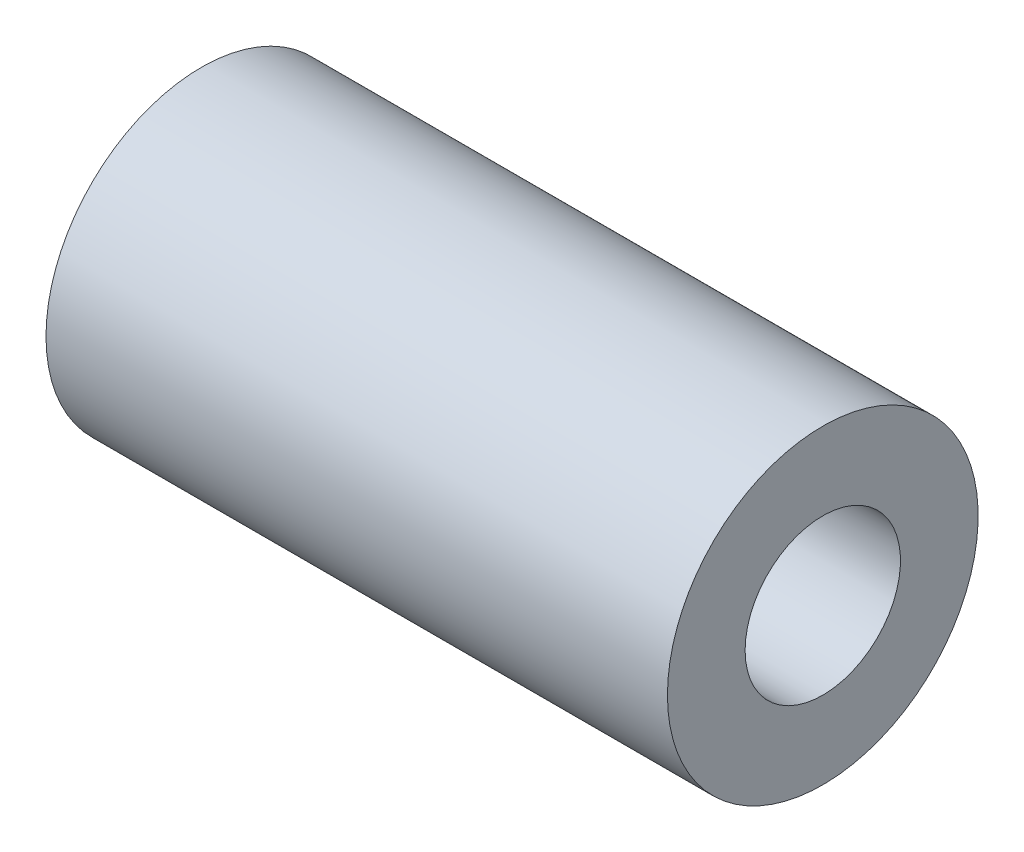
ISO-10303-21;
HEADER;
FILE_DESCRIPTION(('STEP AP214'),'2;1');
FILE_NAME('part.step','',(''),(''),'','','');
FILE_SCHEMA(('AUTOMOTIVE_DESIGN { 1 0 10303 214 1 1 1 1 }'));
ENDSEC;
DATA;
#1=APPLICATION_CONTEXT('core data for automotive mechanical design processes');
#2=APPLICATION_PROTOCOL_DEFINITION('international standard','automotive_design',2000,#1);
#3=PRODUCT_CONTEXT('',#1,'mechanical');
#4=PRODUCT('Part','Part','',(#3));
#5=PRODUCT_RELATED_PRODUCT_CATEGORY('part','',(#4));
#6=PRODUCT_DEFINITION_FORMATION('','',#4);
#7=PRODUCT_DEFINITION_CONTEXT('part definition',#1,'design');
#8=PRODUCT_DEFINITION('design','',#6,#7);
#9=PRODUCT_DEFINITION_SHAPE('','',#8);
#10=(LENGTH_UNIT() NAMED_UNIT(*) SI_UNIT(.MILLI.,.METRE.));
#11=(NAMED_UNIT(*) PLANE_ANGLE_UNIT() SI_UNIT($,.RADIAN.));
#12=(NAMED_UNIT(*) SI_UNIT($,.STERADIAN.) SOLID_ANGLE_UNIT());
#13=UNCERTAINTY_MEASURE_WITH_UNIT(LENGTH_MEASURE(1.E-05),#10,'distance_accuracy_value','');
#14=(GEOMETRIC_REPRESENTATION_CONTEXT(3) GLOBAL_UNCERTAINTY_ASSIGNED_CONTEXT((#13)) GLOBAL_UNIT_ASSIGNED_CONTEXT((#10,
#11,#12)) REPRESENTATION_CONTEXT('',''));
#15=CARTESIAN_POINT('',(0.,0.,0.));
#16=DIRECTION('',(0.,0.,1.));
#17=DIRECTION('',(1.,0.,0.));
#18=AXIS2_PLACEMENT_3D('',#15,#16,#17);
#19=CARTESIAN_POINT('',(-5.,0.,0.));
#20=DIRECTION('',(1.,0.,0.));
#21=DIRECTION('',(0.,0.,-1.));
#22=AXIS2_PLACEMENT_3D('',#19,#20,#21);
#23=PLANE('',#22);
#24=CARTESIAN_POINT('',(-5.,0.,0.));
#25=DIRECTION('',(-1.,0.,0.));
#26=DIRECTION('',(0.,0.,1.));
#27=AXIS2_PLACEMENT_3D('',#24,#25,#26);
#28=CIRCLE('',#27,1.25);
#29=CARTESIAN_POINT('',(-5.,0.,1.25));
#30=VERTEX_POINT('',#29);
#31=EDGE_CURVE('E46',#30,#30,#28,.T.);
#32=ORIENTED_EDGE('',*,*,#31,.F.);
#33=EDGE_LOOP('',(#32));
#34=FACE_BOUND('',#33,.T.);
#35=CARTESIAN_POINT('',(-5.,0.,0.));
#36=DIRECTION('',(-1.,0.,0.));
#37=DIRECTION('',(0.,0.,1.));
#38=AXIS2_PLACEMENT_3D('',#35,#36,#37);
#39=CIRCLE('',#38,2.5);
#40=CARTESIAN_POINT('',(-5.,0.,2.5));
#41=VERTEX_POINT('',#40);
#42=EDGE_CURVE('E10',#41,#41,#39,.T.);
#43=ORIENTED_EDGE('',*,*,#42,.T.);
#44=EDGE_LOOP('',(#43));
#45=FACE_BOUND('',#44,.T.);
#46=ADVANCED_FACE('F32',(#34,#45),#23,.F.);
#47=CARTESIAN_POINT('',(-5.,0.,0.));
#48=DIRECTION('',(-1.,0.,0.));
#49=DIRECTION('',(0.,0.,1.));
#50=AXIS2_PLACEMENT_3D('',#47,#48,#49);
#51=CYLINDRICAL_SURFACE('',#50,2.5);
#52=ORIENTED_EDGE('',*,*,#42,.F.);
#53=EDGE_LOOP('',(#52));
#54=FACE_BOUND('',#53,.T.);
#55=CARTESIAN_POINT('',(5.,0.,0.));
#56=DIRECTION('',(-1.,0.,0.));
#57=DIRECTION('',(0.,0.,1.));
#58=AXIS2_PLACEMENT_3D('',#55,#56,#57);
#59=CIRCLE('',#58,2.5);
#60=CARTESIAN_POINT('',(5.,0.,2.5));
#61=VERTEX_POINT('',#60);
#62=EDGE_CURVE('E38',#61,#61,#59,.T.);
#63=ORIENTED_EDGE('',*,*,#62,.T.);
#64=EDGE_LOOP('',(#63));
#65=FACE_BOUND('',#64,.T.);
#66=ADVANCED_FACE('F55',(#54,#65),#51,.T.);
#67=CARTESIAN_POINT('',(5.,0.,0.));
#68=DIRECTION('',(-1.,0.,0.));
#69=DIRECTION('',(0.,0.,1.));
#70=AXIS2_PLACEMENT_3D('',#67,#68,#69);
#71=PLANE('',#70);
#72=CARTESIAN_POINT('',(5.,0.,0.));
#73=DIRECTION('',(-1.,0.,0.));
#74=DIRECTION('',(0.,0.,1.));
#75=AXIS2_PLACEMENT_3D('',#72,#73,#74);
#76=CIRCLE('',#75,1.25);
#77=CARTESIAN_POINT('',(5.,0.,1.25));
#78=VERTEX_POINT('',#77);
#79=EDGE_CURVE('E42',#78,#78,#76,.T.);
#80=ORIENTED_EDGE('',*,*,#79,.T.);
#81=EDGE_LOOP('',(#80));
#82=FACE_BOUND('',#81,.T.);
#83=ORIENTED_EDGE('',*,*,#62,.F.);
#84=EDGE_LOOP('',(#83));
#85=FACE_BOUND('',#84,.T.);
#86=ADVANCED_FACE('F59',(#82,#85),#71,.F.);
#87=CARTESIAN_POINT('',(-5.,0.,0.));
#88=DIRECTION('',(-1.,0.,0.));
#89=DIRECTION('',(0.,0.,1.));
#90=AXIS2_PLACEMENT_3D('',#87,#88,#89);
#91=CYLINDRICAL_SURFACE('',#90,1.25);
#92=ORIENTED_EDGE('',*,*,#79,.F.);
#93=EDGE_LOOP('',(#92));
#94=FACE_BOUND('',#93,.T.);
#95=ORIENTED_EDGE('',*,*,#31,.T.);
#96=EDGE_LOOP('',(#95));
#97=FACE_BOUND('',#96,.T.);
#98=ADVANCED_FACE('F52',(#94,#97),#91,.F.);
#99=CLOSED_SHELL('',(#46,#66,#86,#98));
#100=MANIFOLD_SOLID_BREP('B2',#99);
#101=ADVANCED_BREP_SHAPE_REPRESENTATION('',(#18,#100),#14);
#102=SHAPE_DEFINITION_REPRESENTATION(#9,#101);
ENDSEC;
END-ISO-10303-21;
